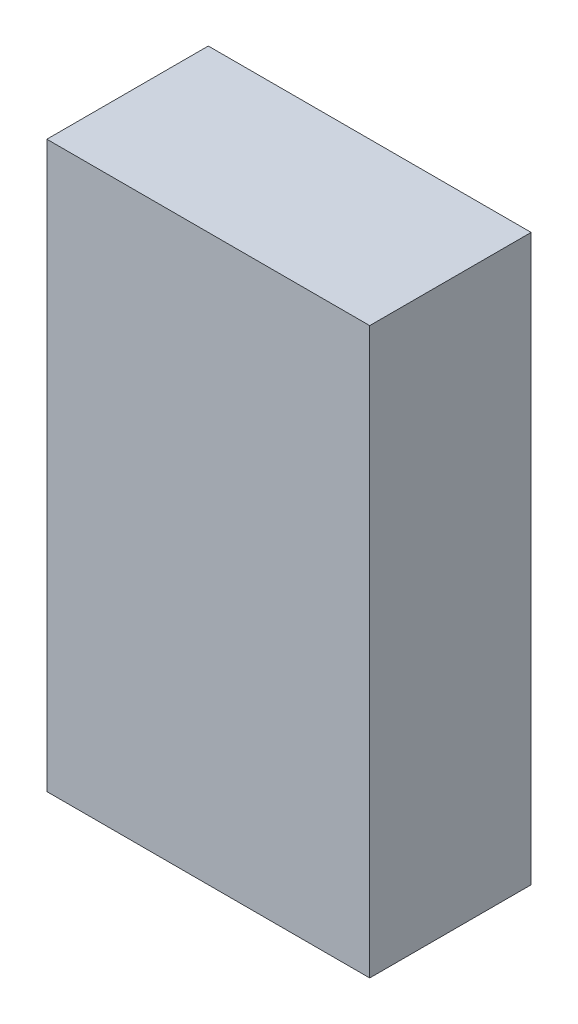
ISO-10303-21;
HEADER;
FILE_DESCRIPTION(('STEP AP214'),'2;1');
FILE_NAME('part.step','',(''),(''),'','','');
FILE_SCHEMA(('AUTOMOTIVE_DESIGN { 1 0 10303 214 1 1 1 1 }'));
ENDSEC;
DATA;
#1=APPLICATION_CONTEXT('core data for automotive mechanical design processes');
#2=APPLICATION_PROTOCOL_DEFINITION('international standard','automotive_design',2000,#1);
#3=PRODUCT_CONTEXT('',#1,'mechanical');
#4=PRODUCT('Part','Part','',(#3));
#5=PRODUCT_RELATED_PRODUCT_CATEGORY('part','',(#4));
#6=PRODUCT_DEFINITION_FORMATION('','',#4);
#7=PRODUCT_DEFINITION_CONTEXT('part definition',#1,'design');
#8=PRODUCT_DEFINITION('design','',#6,#7);
#9=PRODUCT_DEFINITION_SHAPE('','',#8);
#10=(LENGTH_UNIT() NAMED_UNIT(*) SI_UNIT(.MILLI.,.METRE.));
#11=(NAMED_UNIT(*) PLANE_ANGLE_UNIT() SI_UNIT($,.RADIAN.));
#12=(NAMED_UNIT(*) SI_UNIT($,.STERADIAN.) SOLID_ANGLE_UNIT());
#13=UNCERTAINTY_MEASURE_WITH_UNIT(LENGTH_MEASURE(1.E-05),#10,'distance_accuracy_value','');
#14=(GEOMETRIC_REPRESENTATION_CONTEXT(3) GLOBAL_UNCERTAINTY_ASSIGNED_CONTEXT((#13)) GLOBAL_UNIT_ASSIGNED_CONTEXT((#10,
#11,#12)) REPRESENTATION_CONTEXT('',''));
#15=CARTESIAN_POINT('',(0.,0.,0.));
#16=DIRECTION('',(0.,0.,1.));
#17=DIRECTION('',(1.,0.,0.));
#18=AXIS2_PLACEMENT_3D('',#15,#16,#17);
#19=CARTESIAN_POINT('',(25.4,-44.45,25.4));
#20=DIRECTION('',(-1.,0.,0.));
#21=DIRECTION('',(0.,0.,1.));
#22=AXIS2_PLACEMENT_3D('',#19,#20,#21);
#23=PLANE('',#22);
#24=DIRECTION('',(0.,1.,0.));
#25=VECTOR('',#24,1.);
#26=CARTESIAN_POINT('',(25.4,-44.45,0.));
#27=LINE('',#26,#25);
#28=CARTESIAN_POINT('',(25.4,-44.45,0.));
#29=VERTEX_POINT('',#28);
#30=CARTESIAN_POINT('',(25.4,44.45,0.));
#31=VERTEX_POINT('',#30);
#32=EDGE_CURVE('E100',#29,#31,#27,.T.);
#33=ORIENTED_EDGE('',*,*,#32,.T.);
#34=DIRECTION('',(0.,0.,-1.));
#35=VECTOR('',#34,1.);
#36=CARTESIAN_POINT('',(25.4,44.45,25.4));
#37=LINE('',#36,#35);
#38=CARTESIAN_POINT('',(25.4,44.45,25.4));
#39=VERTEX_POINT('',#38);
#40=EDGE_CURVE('E11',#39,#31,#37,.T.);
#41=ORIENTED_EDGE('',*,*,#40,.F.);
#42=DIRECTION('',(0.,1.,0.));
#43=VECTOR('',#42,1.);
#44=CARTESIAN_POINT('',(25.4,-44.45,25.4));
#45=LINE('',#44,#43);
#46=CARTESIAN_POINT('',(25.4,-44.45,25.4));
#47=VERTEX_POINT('',#46);
#48=EDGE_CURVE('E88',#47,#39,#45,.T.);
#49=ORIENTED_EDGE('',*,*,#48,.F.);
#50=DIRECTION('',(0.,0.,-1.));
#51=VECTOR('',#50,1.);
#52=CARTESIAN_POINT('',(25.4,-44.45,25.4));
#53=LINE('',#52,#51);
#54=EDGE_CURVE('E96',#47,#29,#53,.T.);
#55=ORIENTED_EDGE('',*,*,#54,.T.);
#56=EDGE_LOOP('',(#33,#41,#49,#55));
#57=FACE_BOUND('',#56,.T.);
#58=ADVANCED_FACE('F37',(#57),#23,.F.);
#59=CARTESIAN_POINT('',(-25.4,44.45,25.4));
#60=DIRECTION('',(0.,-1.,0.));
#61=DIRECTION('',(0.,0.,-1.));
#62=AXIS2_PLACEMENT_3D('',#59,#60,#61);
#63=PLANE('',#62);
#64=DIRECTION('',(-1.,0.,0.));
#65=VECTOR('',#64,1.);
#66=CARTESIAN_POINT('',(-25.4,44.45,0.));
#67=LINE('',#66,#65);
#68=CARTESIAN_POINT('',(-25.4,44.45,0.));
#69=VERTEX_POINT('',#68);
#70=EDGE_CURVE('E92',#31,#69,#67,.T.);
#71=ORIENTED_EDGE('',*,*,#70,.T.);
#72=DIRECTION('',(0.,0.,-1.));
#73=VECTOR('',#72,1.);
#74=CARTESIAN_POINT('',(-25.4,44.45,25.4));
#75=LINE('',#74,#73);
#76=CARTESIAN_POINT('',(-25.4,44.45,25.4));
#77=VERTEX_POINT('',#76);
#78=EDGE_CURVE('E45',#77,#69,#75,.T.);
#79=ORIENTED_EDGE('',*,*,#78,.F.);
#80=DIRECTION('',(-1.,0.,0.));
#81=VECTOR('',#80,1.);
#82=CARTESIAN_POINT('',(-25.4,44.45,25.4));
#83=LINE('',#82,#81);
#84=EDGE_CURVE('E83',#39,#77,#83,.T.);
#85=ORIENTED_EDGE('',*,*,#84,.F.);
#86=ORIENTED_EDGE('',*,*,#40,.T.);
#87=EDGE_LOOP('',(#71,#79,#85,#86));
#88=FACE_BOUND('',#87,.T.);
#89=ADVANCED_FACE('F91',(#88),#63,.F.);
#90=CARTESIAN_POINT('',(-25.4,-44.45,25.4));
#91=DIRECTION('',(1.,0.,0.));
#92=DIRECTION('',(0.,0.,-1.));
#93=AXIS2_PLACEMENT_3D('',#90,#91,#92);
#94=PLANE('',#93);
#95=DIRECTION('',(0.,-1.,0.));
#96=VECTOR('',#95,1.);
#97=CARTESIAN_POINT('',(-25.4,-44.45,0.));
#98=LINE('',#97,#96);
#99=CARTESIAN_POINT('',(-25.4,-44.45,0.));
#100=VERTEX_POINT('',#99);
#101=EDGE_CURVE('E70',#69,#100,#98,.T.);
#102=ORIENTED_EDGE('',*,*,#101,.T.);
#103=DIRECTION('',(0.,0.,-1.));
#104=VECTOR('',#103,1.);
#105=CARTESIAN_POINT('',(-25.4,-44.45,25.4));
#106=LINE('',#105,#104);
#107=CARTESIAN_POINT('',(-25.4,-44.45,25.4));
#108=VERTEX_POINT('',#107);
#109=EDGE_CURVE('E93',#108,#100,#106,.T.);
#110=ORIENTED_EDGE('',*,*,#109,.F.);
#111=DIRECTION('',(0.,-1.,0.));
#112=VECTOR('',#111,1.);
#113=CARTESIAN_POINT('',(-25.4,-44.45,25.4));
#114=LINE('',#113,#112);
#115=EDGE_CURVE('E86',#77,#108,#114,.T.);
#116=ORIENTED_EDGE('',*,*,#115,.F.);
#117=ORIENTED_EDGE('',*,*,#78,.T.);
#118=EDGE_LOOP('',(#102,#110,#116,#117));
#119=FACE_BOUND('',#118,.T.);
#120=ADVANCED_FACE('F94',(#119),#94,.F.);
#121=CARTESIAN_POINT('',(-25.4,-44.45,25.4));
#122=DIRECTION('',(0.,1.,0.));
#123=DIRECTION('',(0.,0.,1.));
#124=AXIS2_PLACEMENT_3D('',#121,#122,#123);
#125=PLANE('',#124);
#126=DIRECTION('',(1.,0.,0.));
#127=VECTOR('',#126,1.);
#128=CARTESIAN_POINT('',(-25.4,-44.45,0.));
#129=LINE('',#128,#127);
#130=EDGE_CURVE('E76',#100,#29,#129,.T.);
#131=ORIENTED_EDGE('',*,*,#130,.T.);
#132=ORIENTED_EDGE('',*,*,#54,.F.);
#133=DIRECTION('',(1.,0.,0.));
#134=VECTOR('',#133,1.);
#135=CARTESIAN_POINT('',(-25.4,-44.45,25.4));
#136=LINE('',#135,#134);
#137=EDGE_CURVE('E53',#108,#47,#136,.T.);
#138=ORIENTED_EDGE('',*,*,#137,.F.);
#139=ORIENTED_EDGE('',*,*,#109,.T.);
#140=EDGE_LOOP('',(#131,#132,#138,#139));
#141=FACE_BOUND('',#140,.T.);
#142=ADVANCED_FACE('F107',(#141),#125,.F.);
#143=CARTESIAN_POINT('',(0.,0.,25.4));
#144=DIRECTION('',(0.,0.,-1.));
#145=DIRECTION('',(-1.,0.,0.));
#146=AXIS2_PLACEMENT_3D('',#143,#144,#145);
#147=PLANE('',#146);
#148=ORIENTED_EDGE('',*,*,#48,.T.);
#149=ORIENTED_EDGE('',*,*,#84,.T.);
#150=ORIENTED_EDGE('',*,*,#115,.T.);
#151=ORIENTED_EDGE('',*,*,#137,.T.);
#152=EDGE_LOOP('',(#148,#149,#150,#151));
#153=FACE_BOUND('',#152,.T.);
#154=ADVANCED_FACE('F84',(#153),#147,.F.);
#155=CARTESIAN_POINT('',(0.,0.,0.));
#156=DIRECTION('',(0.,0.,-1.));
#157=DIRECTION('',(-1.,0.,0.));
#158=AXIS2_PLACEMENT_3D('',#155,#156,#157);
#159=PLANE('',#158);
#160=ORIENTED_EDGE('',*,*,#32,.F.);
#161=ORIENTED_EDGE('',*,*,#130,.F.);
#162=ORIENTED_EDGE('',*,*,#101,.F.);
#163=ORIENTED_EDGE('',*,*,#70,.F.);
#164=EDGE_LOOP('',(#160,#161,#162,#163));
#165=FACE_BOUND('',#164,.T.);
#166=ADVANCED_FACE('F110',(#165),#159,.T.);
#167=CLOSED_SHELL('',(#58,#89,#120,#142,#154,#166));
#168=MANIFOLD_SOLID_BREP('B2',#167);
#169=ADVANCED_BREP_SHAPE_REPRESENTATION('',(#18,#168),#14);
#170=SHAPE_DEFINITION_REPRESENTATION(#9,#169);
ENDSEC;
END-ISO-10303-21;
